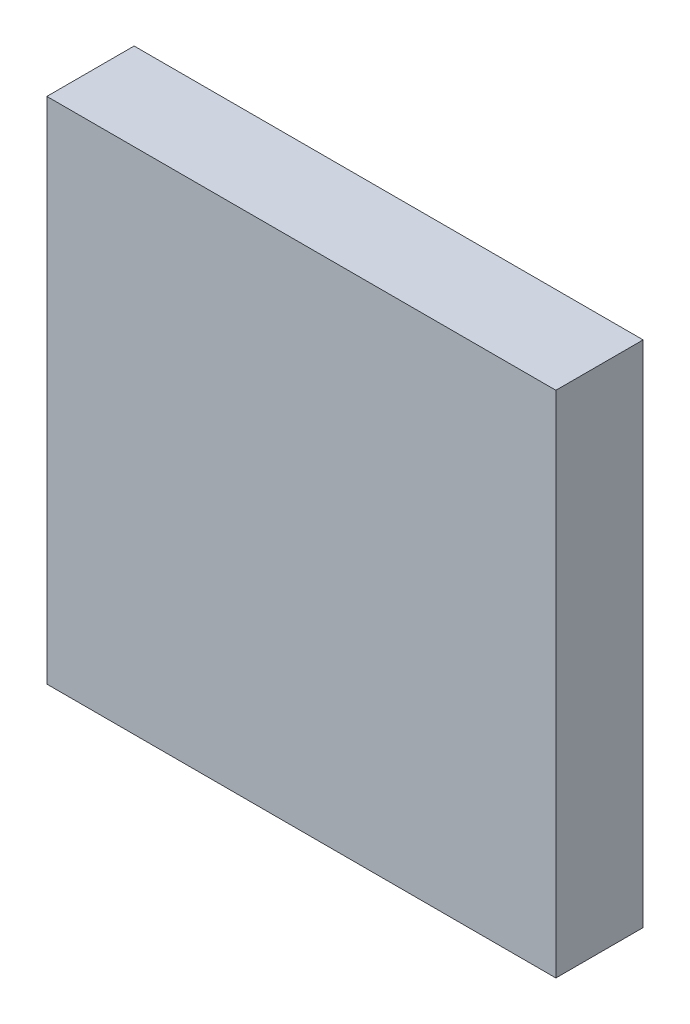
ISO-10303-21;
HEADER;
FILE_DESCRIPTION(('STEP AP214'),'2;1');
FILE_NAME('part.step','',(''),(''),'','','');
FILE_SCHEMA(('AUTOMOTIVE_DESIGN { 1 0 10303 214 1 1 1 1 }'));
ENDSEC;
DATA;
#1=APPLICATION_CONTEXT('core data for automotive mechanical design processes');
#2=APPLICATION_PROTOCOL_DEFINITION('international standard','automotive_design',2000,#1);
#3=PRODUCT_CONTEXT('',#1,'mechanical');
#4=PRODUCT('Part','Part','',(#3));
#5=PRODUCT_RELATED_PRODUCT_CATEGORY('part','',(#4));
#6=PRODUCT_DEFINITION_FORMATION('','',#4);
#7=PRODUCT_DEFINITION_CONTEXT('part definition',#1,'design');
#8=PRODUCT_DEFINITION('design','',#6,#7);
#9=PRODUCT_DEFINITION_SHAPE('','',#8);
#10=(LENGTH_UNIT() NAMED_UNIT(*) SI_UNIT(.MILLI.,.METRE.));
#11=(NAMED_UNIT(*) PLANE_ANGLE_UNIT() SI_UNIT($,.RADIAN.));
#12=(NAMED_UNIT(*) SI_UNIT($,.STERADIAN.) SOLID_ANGLE_UNIT());
#13=UNCERTAINTY_MEASURE_WITH_UNIT(LENGTH_MEASURE(1.E-05),#10,'distance_accuracy_value','');
#14=(GEOMETRIC_REPRESENTATION_CONTEXT(3) GLOBAL_UNCERTAINTY_ASSIGNED_CONTEXT((#13)) GLOBAL_UNIT_ASSIGNED_CONTEXT((#10,
#11,#12)) REPRESENTATION_CONTEXT('',''));
#15=CARTESIAN_POINT('',(0.,0.,0.));
#16=DIRECTION('',(0.,0.,1.));
#17=DIRECTION('',(1.,0.,0.));
#18=AXIS2_PLACEMENT_3D('',#15,#16,#17);
#19=CARTESIAN_POINT('',(-3.50000062,3.50000062,0.));
#20=DIRECTION('',(1.,0.,0.));
#21=DIRECTION('',(0.,-1.,0.));
#22=AXIS2_PLACEMENT_3D('',#19,#20,#21);
#23=PLANE('',#22);
#24=DIRECTION('',(0.,-1.,0.));
#25=VECTOR('',#24,1.);
#26=CARTESIAN_POINT('',(-3.50000062,3.50000062,0.));
#27=LINE('',#26,#25);
#28=CARTESIAN_POINT('',(-3.50000062,3.50000062,0.));
#29=VERTEX_POINT('',#28);
#30=CARTESIAN_POINT('',(-3.50000062,-3.50000062,0.));
#31=VERTEX_POINT('',#30);
#32=EDGE_CURVE('E11',#29,#31,#27,.T.);
#33=ORIENTED_EDGE('',*,*,#32,.T.);
#34=DIRECTION('',(0.,0.,1.));
#35=VECTOR('',#34,1.);
#36=CARTESIAN_POINT('',(-3.50000062,-3.50000062,0.));
#37=LINE('',#36,#35);
#38=CARTESIAN_POINT('',(-3.50000062,-3.50000062,1.20000014));
#39=VERTEX_POINT('',#38);
#40=EDGE_CURVE('E24',#31,#39,#37,.T.);
#41=ORIENTED_EDGE('',*,*,#40,.T.);
#42=DIRECTION('',(0.,-1.,0.));
#43=VECTOR('',#42,1.);
#44=CARTESIAN_POINT('',(-3.50000062,3.50000062,1.20000014));
#45=LINE('',#44,#43);
#46=CARTESIAN_POINT('',(-3.50000062,3.50000062,1.20000014));
#47=VERTEX_POINT('',#46);
#48=EDGE_CURVE('E87',#47,#39,#45,.T.);
#49=ORIENTED_EDGE('',*,*,#48,.F.);
#50=DIRECTION('',(0.,0.,1.));
#51=VECTOR('',#50,1.);
#52=CARTESIAN_POINT('',(-3.50000062,3.50000062,0.));
#53=LINE('',#52,#51);
#54=EDGE_CURVE('E36',#29,#47,#53,.T.);
#55=ORIENTED_EDGE('',*,*,#54,.F.);
#56=EDGE_LOOP('',(#33,#41,#49,#55));
#57=FACE_BOUND('',#56,.T.);
#58=ADVANCED_FACE('F17',(#57),#23,.F.);
#59=CARTESIAN_POINT('',(-3.50000062,-3.50000062,0.));
#60=DIRECTION('',(0.,1.,0.));
#61=DIRECTION('',(1.,0.,0.));
#62=AXIS2_PLACEMENT_3D('',#59,#60,#61);
#63=PLANE('',#62);
#64=DIRECTION('',(1.,0.,0.));
#65=VECTOR('',#64,1.);
#66=CARTESIAN_POINT('',(-3.50000062,-3.50000062,0.));
#67=LINE('',#66,#65);
#68=CARTESIAN_POINT('',(3.50000062,-3.50000062,0.));
#69=VERTEX_POINT('',#68);
#70=EDGE_CURVE('E84',#31,#69,#67,.T.);
#71=ORIENTED_EDGE('',*,*,#70,.T.);
#72=DIRECTION('',(0.,0.,1.));
#73=VECTOR('',#72,1.);
#74=CARTESIAN_POINT('',(3.50000062,-3.50000062,0.));
#75=LINE('',#74,#73);
#76=CARTESIAN_POINT('',(3.50000062,-3.50000062,1.20000014));
#77=VERTEX_POINT('',#76);
#78=EDGE_CURVE('E82',#69,#77,#75,.T.);
#79=ORIENTED_EDGE('',*,*,#78,.T.);
#80=DIRECTION('',(1.,0.,0.));
#81=VECTOR('',#80,1.);
#82=CARTESIAN_POINT('',(-3.50000062,-3.50000062,1.20000014));
#83=LINE('',#82,#81);
#84=EDGE_CURVE('E62',#39,#77,#83,.T.);
#85=ORIENTED_EDGE('',*,*,#84,.F.);
#86=ORIENTED_EDGE('',*,*,#40,.F.);
#87=EDGE_LOOP('',(#71,#79,#85,#86));
#88=FACE_BOUND('',#87,.T.);
#89=ADVANCED_FACE('F89',(#88),#63,.F.);
#90=CARTESIAN_POINT('',(3.50000062,-3.50000062,0.));
#91=DIRECTION('',(-1.,0.,0.));
#92=DIRECTION('',(0.,1.,0.));
#93=AXIS2_PLACEMENT_3D('',#90,#91,#92);
#94=PLANE('',#93);
#95=DIRECTION('',(0.,1.,0.));
#96=VECTOR('',#95,1.);
#97=CARTESIAN_POINT('',(3.50000062,-3.50000062,0.));
#98=LINE('',#97,#96);
#99=CARTESIAN_POINT('',(3.50000062,3.50000062,0.));
#100=VERTEX_POINT('',#99);
#101=EDGE_CURVE('E71',#69,#100,#98,.T.);
#102=ORIENTED_EDGE('',*,*,#101,.T.);
#103=DIRECTION('',(0.,0.,1.));
#104=VECTOR('',#103,1.);
#105=CARTESIAN_POINT('',(3.50000062,3.50000062,0.));
#106=LINE('',#105,#104);
#107=CARTESIAN_POINT('',(3.50000062,3.50000062,1.20000014));
#108=VERTEX_POINT('',#107);
#109=EDGE_CURVE('E65',#100,#108,#106,.T.);
#110=ORIENTED_EDGE('',*,*,#109,.T.);
#111=DIRECTION('',(0.,1.,0.));
#112=VECTOR('',#111,1.);
#113=CARTESIAN_POINT('',(3.50000062,-3.50000062,1.20000014));
#114=LINE('',#113,#112);
#115=EDGE_CURVE('E57',#77,#108,#114,.T.);
#116=ORIENTED_EDGE('',*,*,#115,.F.);
#117=ORIENTED_EDGE('',*,*,#78,.F.);
#118=EDGE_LOOP('',(#102,#110,#116,#117));
#119=FACE_BOUND('',#118,.T.);
#120=ADVANCED_FACE('F69',(#119),#94,.F.);
#121=CARTESIAN_POINT('',(3.50000062,3.50000062,0.));
#122=DIRECTION('',(0.,-1.,0.));
#123=DIRECTION('',(-1.,0.,0.));
#124=AXIS2_PLACEMENT_3D('',#121,#122,#123);
#125=PLANE('',#124);
#126=DIRECTION('',(-1.,0.,0.));
#127=VECTOR('',#126,1.);
#128=CARTESIAN_POINT('',(3.50000062,3.50000062,0.));
#129=LINE('',#128,#127);
#130=EDGE_CURVE('E66',#100,#29,#129,.T.);
#131=ORIENTED_EDGE('',*,*,#130,.T.);
#132=ORIENTED_EDGE('',*,*,#54,.T.);
#133=DIRECTION('',(-1.,0.,0.));
#134=VECTOR('',#133,1.);
#135=CARTESIAN_POINT('',(3.50000062,3.50000062,1.20000014));
#136=LINE('',#135,#134);
#137=EDGE_CURVE('E61',#108,#47,#136,.T.);
#138=ORIENTED_EDGE('',*,*,#137,.F.);
#139=ORIENTED_EDGE('',*,*,#109,.F.);
#140=EDGE_LOOP('',(#131,#132,#138,#139));
#141=FACE_BOUND('',#140,.T.);
#142=ADVANCED_FACE('F76',(#141),#125,.F.);
#143=CARTESIAN_POINT('',(-3.50000062,3.50000062,0.));
#144=DIRECTION('',(0.,0.,-1.));
#145=DIRECTION('',(-1.,0.,0.));
#146=AXIS2_PLACEMENT_3D('',#143,#144,#145);
#147=PLANE('',#146);
#148=ORIENTED_EDGE('',*,*,#130,.F.);
#149=ORIENTED_EDGE('',*,*,#101,.F.);
#150=ORIENTED_EDGE('',*,*,#70,.F.);
#151=ORIENTED_EDGE('',*,*,#32,.F.);
#152=EDGE_LOOP('',(#148,#149,#150,#151));
#153=FACE_BOUND('',#152,.T.);
#154=ADVANCED_FACE('F91',(#153),#147,.T.);
#155=CARTESIAN_POINT('',(-3.50000062,3.50000062,1.20000014));
#156=DIRECTION('',(0.,0.,-1.));
#157=DIRECTION('',(-1.,0.,0.));
#158=AXIS2_PLACEMENT_3D('',#155,#156,#157);
#159=PLANE('',#158);
#160=ORIENTED_EDGE('',*,*,#48,.T.);
#161=ORIENTED_EDGE('',*,*,#84,.T.);
#162=ORIENTED_EDGE('',*,*,#115,.T.);
#163=ORIENTED_EDGE('',*,*,#137,.T.);
#164=EDGE_LOOP('',(#160,#161,#162,#163));
#165=FACE_BOUND('',#164,.T.);
#166=ADVANCED_FACE('F59',(#165),#159,.F.);
#167=CLOSED_SHELL('',(#58,#89,#120,#142,#154,#166));
#168=MANIFOLD_SOLID_BREP('B1',#167);
#169=ADVANCED_BREP_SHAPE_REPRESENTATION('',(#18,#168),#14);
#170=SHAPE_DEFINITION_REPRESENTATION(#9,#169);
ENDSEC;
END-ISO-10303-21;
